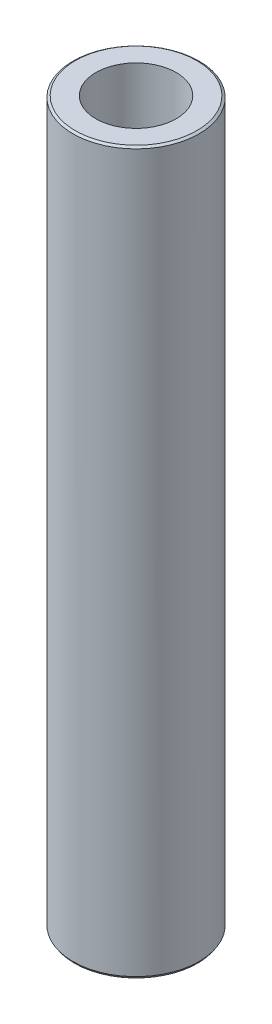
ISO-10303-21;
HEADER;
FILE_DESCRIPTION(('STEP AP214'),'2;1');
FILE_NAME('part.step','',(''),(''),'','','');
FILE_SCHEMA(('AUTOMOTIVE_DESIGN { 1 0 10303 214 1 1 1 1 }'));
ENDSEC;
DATA;
#1=APPLICATION_CONTEXT('core data for automotive mechanical design processes');
#2=APPLICATION_PROTOCOL_DEFINITION('international standard','automotive_design',2000,#1);
#3=PRODUCT_CONTEXT('',#1,'mechanical');
#4=PRODUCT('Part','Part','',(#3));
#5=PRODUCT_RELATED_PRODUCT_CATEGORY('part','',(#4));
#6=PRODUCT_DEFINITION_FORMATION('','',#4);
#7=PRODUCT_DEFINITION_CONTEXT('part definition',#1,'design');
#8=PRODUCT_DEFINITION('design','',#6,#7);
#9=PRODUCT_DEFINITION_SHAPE('','',#8);
#10=(LENGTH_UNIT() NAMED_UNIT(*) SI_UNIT(.MILLI.,.METRE.));
#11=(NAMED_UNIT(*) PLANE_ANGLE_UNIT() SI_UNIT($,.RADIAN.));
#12=(NAMED_UNIT(*) SI_UNIT($,.STERADIAN.) SOLID_ANGLE_UNIT());
#13=UNCERTAINTY_MEASURE_WITH_UNIT(LENGTH_MEASURE(1.E-05),#10,'distance_accuracy_value','');
#14=(GEOMETRIC_REPRESENTATION_CONTEXT(3) GLOBAL_UNCERTAINTY_ASSIGNED_CONTEXT((#13)) GLOBAL_UNIT_ASSIGNED_CONTEXT((#10,
#11,#12)) REPRESENTATION_CONTEXT('',''));
#15=CARTESIAN_POINT('',(0.,0.,0.));
#16=DIRECTION('',(0.,0.,1.));
#17=DIRECTION('',(1.,0.,0.));
#18=AXIS2_PLACEMENT_3D('',#15,#16,#17);
#19=CARTESIAN_POINT('',(0.,600.,0.));
#20=DIRECTION('',(0.,-1.,0.));
#21=DIRECTION('',(0.,0.,-1.));
#22=AXIS2_PLACEMENT_3D('',#19,#20,#21);
#23=CYLINDRICAL_SURFACE('',#22,52.5);
#24=CARTESIAN_POINT('',(0.,598.70865289519,0.));
#25=DIRECTION('',(0.,1.,0.));
#26=DIRECTION('',(0.,0.,1.));
#27=AXIS2_PLACEMENT_3D('',#24,#25,#26);
#28=CIRCLE('',#27,52.5);
#29=CARTESIAN_POINT('',(0.,598.70865289519,-52.5000000000001));
#30=VERTEX_POINT('',#29);
#31=EDGE_CURVE('E50',#30,#30,#28,.F.);
#32=ORIENTED_EDGE('',*,*,#31,.T.);
#33=EDGE_LOOP('',(#32));
#34=FACE_BOUND('',#33,.T.);
#35=CARTESIAN_POINT('',(0.,1.93010324512577,0.));
#36=DIRECTION('',(0.,1.,0.));
#37=DIRECTION('',(0.,0.,1.));
#38=AXIS2_PLACEMENT_3D('',#35,#36,#37);
#39=CIRCLE('',#38,52.5);
#40=CARTESIAN_POINT('',(0.,1.93010324512577,52.5));
#41=VERTEX_POINT('',#40);
#42=EDGE_CURVE('E51',#41,#41,#39,.T.);
#43=ORIENTED_EDGE('',*,*,#42,.T.);
#44=EDGE_LOOP('',(#43));
#45=FACE_BOUND('',#44,.T.);
#46=ADVANCED_FACE('F39',(#34,#45),#23,.T.);
#47=CARTESIAN_POINT('',(0.,600.,0.));
#48=DIRECTION('',(0.,1.,0.));
#49=DIRECTION('',(0.,0.,1.));
#50=AXIS2_PLACEMENT_3D('',#47,#48,#49);
#51=PLANE('',#50);
#52=CARTESIAN_POINT('',(0.,600.,0.));
#53=DIRECTION('',(0.,1.,0.));
#54=DIRECTION('',(0.,0.,1.));
#55=AXIS2_PLACEMENT_3D('',#52,#53,#54);
#56=CIRCLE('',#55,50.569896754874);
#57=CARTESIAN_POINT('',(0.,600.,-50.5698967548741));
#58=VERTEX_POINT('',#57);
#59=EDGE_CURVE('E54',#58,#58,#56,.T.);
#60=ORIENTED_EDGE('',*,*,#59,.T.);
#61=EDGE_LOOP('',(#60));
#62=FACE_BOUND('',#61,.T.);
#63=CARTESIAN_POINT('',(0.,600.,0.));
#64=DIRECTION('',(0.,1.,0.));
#65=DIRECTION('',(0.,0.,1.));
#66=AXIS2_PLACEMENT_3D('',#63,#64,#65);
#67=CIRCLE('',#66,33.418537963169);
#68=CARTESIAN_POINT('',(0.,600.,33.418537963169));
#69=VERTEX_POINT('',#68);
#70=EDGE_CURVE('E58',#69,#69,#67,.T.);
#71=ORIENTED_EDGE('',*,*,#70,.F.);
#72=EDGE_LOOP('',(#71));
#73=FACE_BOUND('',#72,.T.);
#74=ADVANCED_FACE('F69',(#62,#73),#51,.T.);
#75=CARTESIAN_POINT('',(0.,0.,0.));
#76=DIRECTION('',(0.,1.,0.));
#77=DIRECTION('',(0.,0.,1.));
#78=AXIS2_PLACEMENT_3D('',#75,#76,#77);
#79=PLANE('',#78);
#80=CARTESIAN_POINT('',(0.,0.,0.));
#81=DIRECTION('',(0.,1.,0.));
#82=DIRECTION('',(0.,0.,1.));
#83=AXIS2_PLACEMENT_3D('',#80,#81,#82);
#84=CIRCLE('',#83,51.2086528951901);
#85=CARTESIAN_POINT('',(0.,0.,51.2086528951901));
#86=VERTEX_POINT('',#85);
#87=EDGE_CURVE('E10',#86,#86,#84,.F.);
#88=ORIENTED_EDGE('',*,*,#87,.T.);
#89=EDGE_LOOP('',(#88));
#90=FACE_BOUND('',#89,.T.);
#91=CARTESIAN_POINT('',(0.,0.,0.));
#92=DIRECTION('',(0.,1.,0.));
#93=DIRECTION('',(0.,0.,1.));
#94=AXIS2_PLACEMENT_3D('',#91,#92,#93);
#95=CIRCLE('',#94,33.418537963169);
#96=CARTESIAN_POINT('',(0.,0.,33.418537963169));
#97=VERTEX_POINT('',#96);
#98=EDGE_CURVE('E63',#97,#97,#95,.T.);
#99=ORIENTED_EDGE('',*,*,#98,.T.);
#100=EDGE_LOOP('',(#99));
#101=FACE_BOUND('',#100,.T.);
#102=ADVANCED_FACE('F75',(#90,#101),#79,.F.);
#103=CARTESIAN_POINT('',(0.,600.,0.));
#104=DIRECTION('',(0.,-1.,0.));
#105=DIRECTION('',(0.,0.,-1.));
#106=AXIS2_PLACEMENT_3D('',#103,#104,#105);
#107=CYLINDRICAL_SURFACE('',#106,33.418537963169);
#108=ORIENTED_EDGE('',*,*,#70,.T.);
#109=EDGE_LOOP('',(#108));
#110=FACE_BOUND('',#109,.T.);
#111=ORIENTED_EDGE('',*,*,#98,.F.);
#112=EDGE_LOOP('',(#111));
#113=FACE_BOUND('',#112,.T.);
#114=ADVANCED_FACE('F70',(#110,#113),#107,.F.);
#115=CARTESIAN_POINT('',(0.,600.,0.));
#116=DIRECTION('',(0.,-1.,0.));
#117=DIRECTION('',(0.,0.,-1.));
#118=AXIS2_PLACEMENT_3D('',#115,#116,#117);
#119=CONICAL_SURFACE('',#118,50.569896754874,0.981141411642231);
#120=CARTESIAN_POINT('',(0.,598.70865289519,-52.5000000000001));
#121=CARTESIAN_POINT('',(0.,598.722104427532,-52.4798947578634));
#122=CARTESIAN_POINT('',(0.,598.735555959873,-52.4597895157266));
#123=CARTESIAN_POINT('',(0.,598.762459024557,-52.4195790314532));
#124=CARTESIAN_POINT('',(0.,598.775910556899,-52.3994737893164));
#125=CARTESIAN_POINT('',(0.,598.802813621582,-52.359263305043));
#126=CARTESIAN_POINT('',(0.,598.816265153924,-52.3391580629062));
#127=CARTESIAN_POINT('',(0.,598.843168218608,-52.2989475786328));
#128=CARTESIAN_POINT('',(0.,598.856619750949,-52.2788423364961));
#129=CARTESIAN_POINT('',(0.,598.883522815633,-52.2386318522226));
#130=CARTESIAN_POINT('',(0.,598.896974347975,-52.2185266100859));
#131=CARTESIAN_POINT('',(0.,598.923877412658,-52.1783161258124));
#132=CARTESIAN_POINT('',(0.,598.937328945,-52.1582108836757));
#133=CARTESIAN_POINT('',(0.,598.964232009684,-52.1180003994022));
#134=CARTESIAN_POINT('',(0.,598.977683542025,-52.0978951572655));
#135=CARTESIAN_POINT('',(0.,599.004586606709,-52.057684672992));
#136=CARTESIAN_POINT('',(0.,599.018038139051,-52.0375794308553));
#137=CARTESIAN_POINT('',(0.,599.044941203734,-51.9973689465819));
#138=CARTESIAN_POINT('',(0.,599.058392736076,-51.9772637044451));
#139=CARTESIAN_POINT('',(0.,599.08529580076,-51.9370532201717));
#140=CARTESIAN_POINT('',(0.,599.098747333101,-51.9169479780349));
#141=CARTESIAN_POINT('',(0.,599.125650397785,-51.8767374937615));
#142=CARTESIAN_POINT('',(0.,599.139101930127,-51.8566322516247));
#143=CARTESIAN_POINT('',(0.,599.16600499481,-51.8164217673513));
#144=CARTESIAN_POINT('',(0.,599.179456527152,-51.7963165252146));
#145=CARTESIAN_POINT('',(0.,599.206359591835,-51.7561060409411));
#146=CARTESIAN_POINT('',(0.,599.219811124177,-51.7360007988044));
#147=CARTESIAN_POINT('',(0.,599.246714188861,-51.6957903145309));
#148=CARTESIAN_POINT('',(0.,599.260165721202,-51.6756850723942));
#149=CARTESIAN_POINT('',(0.,599.287068785886,-51.6354745881207));
#150=CARTESIAN_POINT('',(0.,599.300520318228,-51.615369345984));
#151=CARTESIAN_POINT('',(0.,599.327423382911,-51.5751588617105));
#152=CARTESIAN_POINT('',(0.,599.340874915253,-51.5550536195738));
#153=CARTESIAN_POINT('',(0.,599.367777979937,-51.5148431353004));
#154=CARTESIAN_POINT('',(0.,599.381229512278,-51.4947378931636));
#155=CARTESIAN_POINT('',(0.,599.408132576962,-51.4545274088902));
#156=CARTESIAN_POINT('',(0.,599.421584109304,-51.4344221667534));
#157=CARTESIAN_POINT('',(0.,599.448487173987,-51.39421168248));
#158=CARTESIAN_POINT('',(0.,599.461938706329,-51.3741064403432));
#159=CARTESIAN_POINT('',(0.,599.488841771013,-51.3338959560698));
#160=CARTESIAN_POINT('',(0.,599.502293303354,-51.3137907139331));
#161=CARTESIAN_POINT('',(0.,599.529196368038,-51.2735802296596));
#162=CARTESIAN_POINT('',(0.,599.54264790038,-51.2534749875229));
#163=CARTESIAN_POINT('',(0.,599.569550965063,-51.2132645032494));
#164=CARTESIAN_POINT('',(0.,599.583002497405,-51.1931592611127));
#165=CARTESIAN_POINT('',(0.,599.609905562089,-51.1529487768392));
#166=CARTESIAN_POINT('',(0.,599.62335709443,-51.1328435347025));
#167=CARTESIAN_POINT('',(0.,599.650260159114,-51.092633050429));
#168=CARTESIAN_POINT('',(0.,599.663711691456,-51.0725278082923));
#169=CARTESIAN_POINT('',(0.,599.690614756139,-51.0323173240189));
#170=CARTESIAN_POINT('',(0.,599.704066288481,-51.0122120818821));
#171=CARTESIAN_POINT('',(0.,599.730969353164,-50.9720015976087));
#172=CARTESIAN_POINT('',(0.,599.744420885506,-50.9518963554719));
#173=CARTESIAN_POINT('',(0.,599.77132395019,-50.9116858711985));
#174=CARTESIAN_POINT('',(0.,599.784775482532,-50.8915806290618));
#175=CARTESIAN_POINT('',(0.,599.811678547215,-50.8513701447883));
#176=CARTESIAN_POINT('',(0.,599.825130079557,-50.8312649026516));
#177=CARTESIAN_POINT('',(0.,599.85203314424,-50.7910544183781));
#178=CARTESIAN_POINT('',(0.,599.865484676582,-50.7709491762414));
#179=CARTESIAN_POINT('',(0.,599.892387741266,-50.7307386919679));
#180=CARTESIAN_POINT('',(0.,599.905839273608,-50.7106334498312));
#181=CARTESIAN_POINT('',(0.,599.932742338291,-50.6704229655577));
#182=CARTESIAN_POINT('',(0.,599.946193870633,-50.650317723421));
#183=CARTESIAN_POINT('',(0.,599.973096935316,-50.6101072391476));
#184=CARTESIAN_POINT('',(0.,599.986548467658,-50.5900019970108));
#185=CARTESIAN_POINT('',(0.,600.,-50.5698967548741));
#186=B_SPLINE_CURVE_WITH_KNOTS('',3,(#120,#121,#122,#123,#124,#125,#126,#127,#128,#129,#130,
#131,#132,#133,#134,#135,#136,#137,#138,#139,#140,#141,#142,#143,#144,#145,#146,#147,#148,#149,
#150,#151,#152,#153,#154,#155,#156,#157,#158,#159,#160,#161,#162,#163,#164,#165,#166,#167,#168,
#169,#170,#171,#172,#173,#174,#175,#176,#177,#178,#179,#180,#181,#182,#183,#184,#185),
.UNSPECIFIED.,.F.,.F.,(4,2,2,2,2,2,2,2,2,2,2,2,2,2,2,2,2,2,2,2,2,2,2,2,2,2,2,2,2,2,2,2,4),(0.,
0.0725705198649286,0.145141039729857,0.217711559594786,0.290282079459714,0.362852599324581,
0.43542311918951,0.507993639054439,0.580564158919367,0.653134678784296,0.725705198649163,
0.798275718514091,0.87084623837902,0.943416758243949,1.01598727810882,1.08855779797374,
1.16112831783867,1.2336988377036,1.30626935756853,1.3788398774334,1.45141039729833,
1.52398091716325,1.59655143702818,1.66912195689305,1.74169247675798,1.81426299662291,
1.88683351648783,1.95940403635276,2.03197455621763,2.10454507608256,2.17711559594749,
2.24968611581242,2.32225663567734),.UNSPECIFIED.);
#187=EDGE_CURVE('BSEAM81',#30,#58,#186,.T.);
#188=ORIENTED_EDGE('',*,*,#31,.F.);
#189=ORIENTED_EDGE('',*,*,#59,.F.);
#190=ORIENTED_EDGE('',*,*,#187,.T.);
#191=ORIENTED_EDGE('',*,*,#187,.F.);
#192=EDGE_LOOP('',(#188,#190,#189,#191));
#193=FACE_BOUND('',#192,.T.);
#194=ADVANCED_FACE('F81',(#193),#119,.T.);
#195=CARTESIAN_POINT('',(0.,1.93010324512577,0.));
#196=DIRECTION('',(0.,1.,0.));
#197=DIRECTION('',(0.,0.,1.));
#198=AXIS2_PLACEMENT_3D('',#195,#196,#197);
#199=CONICAL_SURFACE('',#198,52.5,0.589654915152662);
#200=ORIENTED_EDGE('',*,*,#87,.F.);
#201=EDGE_LOOP('',(#200));
#202=FACE_BOUND('',#201,.T.);
#203=ORIENTED_EDGE('',*,*,#42,.F.);
#204=EDGE_LOOP('',(#203));
#205=FACE_BOUND('',#204,.T.);
#206=ADVANCED_FACE('F45',(#202,#205),#199,.T.);
#207=CLOSED_SHELL('',(#46,#74,#102,#114,#194,#206));
#208=MANIFOLD_SOLID_BREP('B2',#207);
#209=ADVANCED_BREP_SHAPE_REPRESENTATION('',(#18,#208),#14);
#210=SHAPE_DEFINITION_REPRESENTATION(#9,#209);
ENDSEC;
END-ISO-10303-21;
